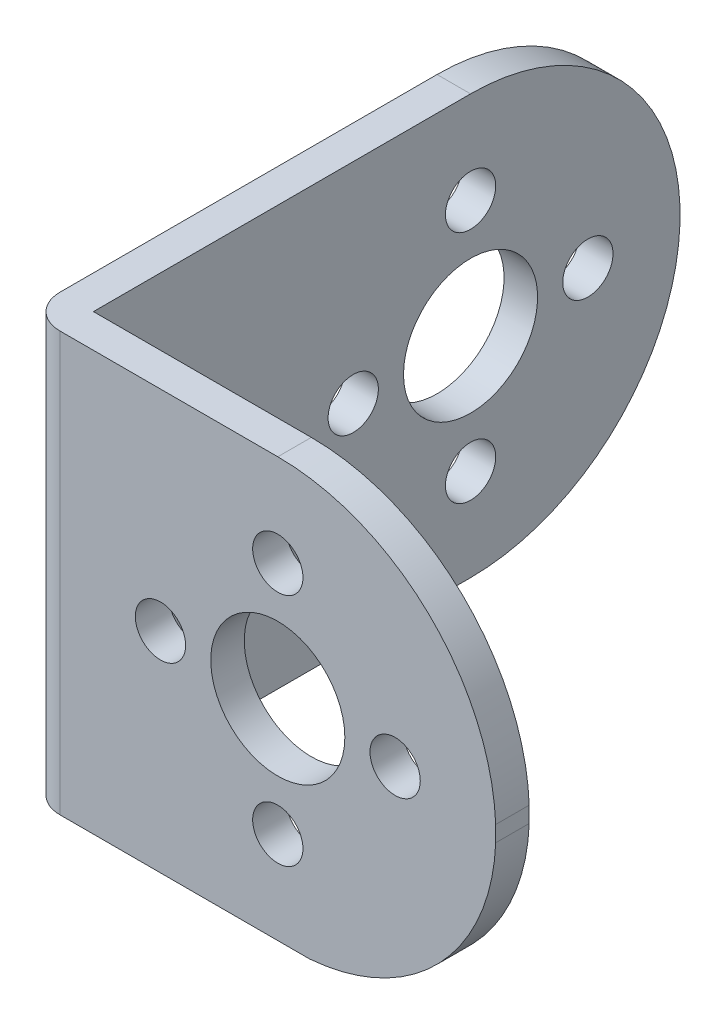
ISO-10303-21;
HEADER;
FILE_DESCRIPTION(('STEP AP214'),'2;1');
FILE_NAME('part.step','',(''),(''),'','','');
FILE_SCHEMA(('AUTOMOTIVE_DESIGN { 1 0 10303 214 1 1 1 1 }'));
ENDSEC;
DATA;
#1=APPLICATION_CONTEXT('core data for automotive mechanical design processes');
#2=APPLICATION_PROTOCOL_DEFINITION('international standard','automotive_design',2000,#1);
#3=PRODUCT_CONTEXT('',#1,'mechanical');
#4=PRODUCT('Part','Part','',(#3));
#5=PRODUCT_RELATED_PRODUCT_CATEGORY('part','',(#4));
#6=PRODUCT_DEFINITION_FORMATION('','',#4);
#7=PRODUCT_DEFINITION_CONTEXT('part definition',#1,'design');
#8=PRODUCT_DEFINITION('design','',#6,#7);
#9=PRODUCT_DEFINITION_SHAPE('','',#8);
#10=(LENGTH_UNIT() NAMED_UNIT(*) SI_UNIT(.MILLI.,.METRE.));
#11=(NAMED_UNIT(*) PLANE_ANGLE_UNIT() SI_UNIT($,.RADIAN.));
#12=(NAMED_UNIT(*) SI_UNIT($,.STERADIAN.) SOLID_ANGLE_UNIT());
#13=UNCERTAINTY_MEASURE_WITH_UNIT(LENGTH_MEASURE(1.E-05),#10,'distance_accuracy_value','');
#14=(GEOMETRIC_REPRESENTATION_CONTEXT(3) GLOBAL_UNCERTAINTY_ASSIGNED_CONTEXT((#13)) GLOBAL_UNIT_ASSIGNED_CONTEXT((#10,
#11,#12)) REPRESENTATION_CONTEXT('',''));
#15=CARTESIAN_POINT('',(0.,0.,0.));
#16=DIRECTION('',(0.,0.,1.));
#17=DIRECTION('',(1.,0.,0.));
#18=AXIS2_PLACEMENT_3D('',#15,#16,#17);
#19=CARTESIAN_POINT('',(11.0355305674655,25.,2.48106060606061));
#20=DIRECTION('',(-1.,0.,0.));
#21=DIRECTION('',(0.,0.,1.));
#22=AXIS2_PLACEMENT_3D('',#19,#20,#21);
#23=PLANE('',#22);
#24=DIRECTION('',(0.,0.,1.));
#25=VECTOR('',#24,1.);
#26=CARTESIAN_POINT('',(11.0355305674655,12.5,-32.5189393939394));
#27=LINE('',#26,#25);
#28=CARTESIAN_POINT('',(11.0355305674655,12.5,2.48106060606061));
#29=VERTEX_POINT('',#28);
#30=CARTESIAN_POINT('',(11.0355305674655,12.5,4.48106060606061));
#31=VERTEX_POINT('',#30);
#32=EDGE_CURVE('E116',#29,#31,#27,.T.);
#33=ORIENTED_EDGE('',*,*,#32,.T.);
#34=DIRECTION('',(0.,-1.,0.));
#35=VECTOR('',#34,1.);
#36=CARTESIAN_POINT('',(11.0355305674655,25.,4.48106060606061));
#37=LINE('',#36,#35);
#38=CARTESIAN_POINT('',(11.0355305674655,11.5541553813258,4.48106060606061));
#39=VERTEX_POINT('',#38);
#40=EDGE_CURVE('E128',#31,#39,#37,.T.);
#41=ORIENTED_EDGE('',*,*,#40,.T.);
#42=DIRECTION('',(0.,0.,1.));
#43=VECTOR('',#42,1.);
#44=CARTESIAN_POINT('',(11.0355305674655,11.5541553813258,-32.5189393939394));
#45=LINE('',#44,#43);
#46=CARTESIAN_POINT('',(11.0355305674655,11.5541553813258,2.48106060606061));
#47=VERTEX_POINT('',#46);
#48=EDGE_CURVE('E122',#47,#39,#45,.T.);
#49=ORIENTED_EDGE('',*,*,#48,.F.);
#50=DIRECTION('',(0.,-1.,0.));
#51=VECTOR('',#50,1.);
#52=CARTESIAN_POINT('',(11.0355305674655,25.,2.48106060606061));
#53=LINE('',#52,#51);
#54=EDGE_CURVE('E130',#29,#47,#53,.T.);
#55=ORIENTED_EDGE('',*,*,#54,.F.);
#56=EDGE_LOOP('',(#33,#41,#49,#55));
#57=FACE_BOUND('',#56,.T.);
#58=ADVANCED_FACE('F44',(#57),#23,.F.);
#59=CARTESIAN_POINT('',(-14.9644694325345,25.,2.48106060606061));
#60=DIRECTION('',(0.,0.,1.));
#61=DIRECTION('',(1.,0.,0.));
#62=AXIS2_PLACEMENT_3D('',#59,#60,#61);
#63=PLANE('',#62);
#64=CARTESIAN_POINT('',(-1.96446943253454,19.5,2.48106060606061));
#65=DIRECTION('',(0.,0.,1.));
#66=DIRECTION('',(1.,0.,0.));
#67=AXIS2_PLACEMENT_3D('',#64,#65,#66);
#68=CIRCLE('',#67,1.5);
#69=CARTESIAN_POINT('',(-0.46446943253454,19.5,2.48106060606061));
#70=VERTEX_POINT('',#69);
#71=EDGE_CURVE('E235',#70,#70,#68,.T.);
#72=ORIENTED_EDGE('',*,*,#71,.T.);
#73=EDGE_LOOP('',(#72));
#74=FACE_BOUND('',#73,.T.);
#75=CARTESIAN_POINT('',(-1.96446943253454,5.5,2.48106060606061));
#76=DIRECTION('',(0.,0.,1.));
#77=DIRECTION('',(1.,0.,0.));
#78=AXIS2_PLACEMENT_3D('',#75,#76,#77);
#79=CIRCLE('',#78,1.5);
#80=CARTESIAN_POINT('',(-0.464469432534539,5.5,2.48106060606061));
#81=VERTEX_POINT('',#80);
#82=EDGE_CURVE('E240',#81,#81,#79,.T.);
#83=ORIENTED_EDGE('',*,*,#82,.T.);
#84=EDGE_LOOP('',(#83));
#85=FACE_BOUND('',#84,.T.);
#86=CARTESIAN_POINT('',(5.03553056746546,12.5,2.48106060606061));
#87=DIRECTION('',(0.,0.,1.));
#88=DIRECTION('',(1.,0.,0.));
#89=AXIS2_PLACEMENT_3D('',#86,#87,#88);
#90=CIRCLE('',#89,1.5);
#91=CARTESIAN_POINT('',(6.53553056746546,12.5,2.48106060606061));
#92=VERTEX_POINT('',#91);
#93=EDGE_CURVE('E244',#92,#92,#90,.T.);
#94=ORIENTED_EDGE('',*,*,#93,.T.);
#95=EDGE_LOOP('',(#94));
#96=FACE_BOUND('',#95,.T.);
#97=CARTESIAN_POINT('',(-8.96446943253454,12.5,2.48106060606061));
#98=DIRECTION('',(0.,0.,1.));
#99=DIRECTION('',(1.,0.,0.));
#100=AXIS2_PLACEMENT_3D('',#97,#98,#99);
#101=CIRCLE('',#100,1.5);
#102=CARTESIAN_POINT('',(-7.46446943253454,12.5,2.48106060606061));
#103=VERTEX_POINT('',#102);
#104=EDGE_CURVE('E248',#103,#103,#101,.T.);
#105=ORIENTED_EDGE('',*,*,#104,.T.);
#106=EDGE_LOOP('',(#105));
#107=FACE_BOUND('',#106,.T.);
#108=CARTESIAN_POINT('',(-1.96446943253454,12.5,2.48106060606061));
#109=DIRECTION('',(0.,0.,1.));
#110=DIRECTION('',(1.,0.,0.));
#111=AXIS2_PLACEMENT_3D('',#108,#109,#110);
#112=CIRCLE('',#111,4.);
#113=CARTESIAN_POINT('',(2.03553056746546,12.5,2.48106060606061));
#114=VERTEX_POINT('',#113);
#115=EDGE_CURVE('E252',#114,#114,#112,.T.);
#116=ORIENTED_EDGE('',*,*,#115,.T.);
#117=EDGE_LOOP('',(#116));
#118=FACE_BOUND('',#117,.T.);
#119=CARTESIAN_POINT('',(-1.96446943253455,11.99,2.48106060606061));
#120=DIRECTION('',(0.,0.,1.));
#121=DIRECTION('',(1.,0.,0.));
#122=AXIS2_PLACEMENT_3D('',#119,#120,#121);
#123=CIRCLE('',#122,13.01);
#124=CARTESIAN_POINT('',(-1.96446943253455,25.,2.48106060606061));
#125=VERTEX_POINT('',#124);
#126=EDGE_CURVE('E59',#29,#125,#123,.T.);
#127=ORIENTED_EDGE('',*,*,#126,.F.);
#128=ORIENTED_EDGE('',*,*,#54,.T.);
#129=CARTESIAN_POINT('',(-1.01935182740269,12.0270776906629,2.48106060606061));
#130=DIRECTION('',(0.,0.,1.));
#131=DIRECTION('',(1.,0.,0.));
#132=AXIS2_PLACEMENT_3D('',#129,#130,#131);
#133=CIRCLE('',#132,12.0641553813257);
#134=CARTESIAN_POINT('',(-0.0742342222708013,0.,2.48106060606061));
#135=VERTEX_POINT('',#134);
#136=EDGE_CURVE('E132',#47,#135,#133,.F.);
#137=ORIENTED_EDGE('',*,*,#136,.T.);
#138=DIRECTION('',(-1.,0.,0.));
#139=VECTOR('',#138,1.);
#140=CARTESIAN_POINT('',(-14.9644694325345,0.,2.48106060606061));
#141=LINE('',#140,#139);
#142=CARTESIAN_POINT('',(-14.9644694325345,0.,2.48106060606061));
#143=VERTEX_POINT('',#142);
#144=EDGE_CURVE('E182',#135,#143,#141,.T.);
#145=ORIENTED_EDGE('',*,*,#144,.T.);
#146=DIRECTION('',(0.,-1.,0.));
#147=VECTOR('',#146,1.);
#148=CARTESIAN_POINT('',(-14.9644694325345,25.,2.48106060606061));
#149=LINE('',#148,#147);
#150=CARTESIAN_POINT('',(-14.9644694325345,25.,2.48106060606061));
#151=VERTEX_POINT('',#150);
#152=EDGE_CURVE('E137',#151,#143,#149,.T.);
#153=ORIENTED_EDGE('',*,*,#152,.F.);
#154=DIRECTION('',(-1.,0.,0.));
#155=VECTOR('',#154,1.);
#156=CARTESIAN_POINT('',(-14.9644694325345,25.,2.48106060606061));
#157=LINE('',#156,#155);
#158=EDGE_CURVE('E205',#125,#151,#157,.T.);
#159=ORIENTED_EDGE('',*,*,#158,.F.);
#160=EDGE_LOOP('',(#127,#128,#137,#145,#153,#159));
#161=FACE_BOUND('',#160,.T.);
#162=ADVANCED_FACE('F180',(#74,#85,#96,#107,#118,#161),#63,.F.);
#163=CARTESIAN_POINT('',(11.0355305674655,25.,4.48106060606061));
#164=DIRECTION('',(0.,0.,-1.));
#165=DIRECTION('',(-1.,0.,0.));
#166=AXIS2_PLACEMENT_3D('',#163,#164,#165);
#167=PLANE('',#166);
#168=CARTESIAN_POINT('',(-1.96446943253454,19.5,4.48106060606061));
#169=DIRECTION('',(0.,0.,1.));
#170=DIRECTION('',(1.,0.,0.));
#171=AXIS2_PLACEMENT_3D('',#168,#169,#170);
#172=CIRCLE('',#171,1.5);
#173=CARTESIAN_POINT('',(-0.46446943253454,19.5,4.48106060606061));
#174=VERTEX_POINT('',#173);
#175=EDGE_CURVE('E260',#174,#174,#172,.T.);
#176=ORIENTED_EDGE('',*,*,#175,.F.);
#177=EDGE_LOOP('',(#176));
#178=FACE_BOUND('',#177,.T.);
#179=CARTESIAN_POINT('',(-1.96446943253454,5.5,4.48106060606061));
#180=DIRECTION('',(0.,0.,1.));
#181=DIRECTION('',(1.,0.,0.));
#182=AXIS2_PLACEMENT_3D('',#179,#180,#181);
#183=CIRCLE('',#182,1.5);
#184=CARTESIAN_POINT('',(-0.464469432534539,5.5,4.48106060606061));
#185=VERTEX_POINT('',#184);
#186=EDGE_CURVE('E261',#185,#185,#183,.T.);
#187=ORIENTED_EDGE('',*,*,#186,.F.);
#188=EDGE_LOOP('',(#187));
#189=FACE_BOUND('',#188,.T.);
#190=CARTESIAN_POINT('',(5.03553056746546,12.5,4.48106060606061));
#191=DIRECTION('',(0.,0.,1.));
#192=DIRECTION('',(1.,0.,0.));
#193=AXIS2_PLACEMENT_3D('',#190,#191,#192);
#194=CIRCLE('',#193,1.5);
#195=CARTESIAN_POINT('',(6.53553056746546,12.5,4.48106060606061));
#196=VERTEX_POINT('',#195);
#197=EDGE_CURVE('E265',#196,#196,#194,.T.);
#198=ORIENTED_EDGE('',*,*,#197,.F.);
#199=EDGE_LOOP('',(#198));
#200=FACE_BOUND('',#199,.T.);
#201=CARTESIAN_POINT('',(-8.96446943253454,12.5,4.48106060606061));
#202=DIRECTION('',(0.,0.,1.));
#203=DIRECTION('',(1.,0.,0.));
#204=AXIS2_PLACEMENT_3D('',#201,#202,#203);
#205=CIRCLE('',#204,1.5);
#206=CARTESIAN_POINT('',(-7.46446943253454,12.5,4.48106060606061));
#207=VERTEX_POINT('',#206);
#208=EDGE_CURVE('E269',#207,#207,#205,.T.);
#209=ORIENTED_EDGE('',*,*,#208,.F.);
#210=EDGE_LOOP('',(#209));
#211=FACE_BOUND('',#210,.T.);
#212=CARTESIAN_POINT('',(-1.96446943253454,12.5,4.48106060606061));
#213=DIRECTION('',(0.,0.,1.));
#214=DIRECTION('',(1.,0.,0.));
#215=AXIS2_PLACEMENT_3D('',#212,#213,#214);
#216=CIRCLE('',#215,4.);
#217=CARTESIAN_POINT('',(2.03553056746546,12.5,4.48106060606061));
#218=VERTEX_POINT('',#217);
#219=EDGE_CURVE('E256',#218,#218,#216,.T.);
#220=ORIENTED_EDGE('',*,*,#219,.F.);
#221=EDGE_LOOP('',(#220));
#222=FACE_BOUND('',#221,.T.);
#223=CARTESIAN_POINT('',(-1.96446943253455,11.99,4.48106060606061));
#224=DIRECTION('',(0.,0.,1.));
#225=DIRECTION('',(1.,0.,0.));
#226=AXIS2_PLACEMENT_3D('',#223,#224,#225);
#227=CIRCLE('',#226,13.01);
#228=CARTESIAN_POINT('',(-1.96446943253454,25.,4.48106060606061));
#229=VERTEX_POINT('',#228);
#230=EDGE_CURVE('E113',#31,#229,#227,.T.);
#231=ORIENTED_EDGE('',*,*,#230,.T.);
#232=DIRECTION('',(1.,0.,0.));
#233=VECTOR('',#232,1.);
#234=CARTESIAN_POINT('',(11.0355305674655,25.,4.48106060606061));
#235=LINE('',#234,#233);
#236=CARTESIAN_POINT('',(-14.9644694325345,25.,4.48106060606061));
#237=VERTEX_POINT('',#236);
#238=EDGE_CURVE('E138',#237,#229,#235,.T.);
#239=ORIENTED_EDGE('',*,*,#238,.F.);
#240=DIRECTION('',(0.,-1.,0.));
#241=VECTOR('',#240,1.);
#242=CARTESIAN_POINT('',(-14.9644694325345,25.,4.48106060606061));
#243=LINE('',#242,#241);
#244=CARTESIAN_POINT('',(-14.9644694325345,0.,4.48106060606061));
#245=VERTEX_POINT('',#244);
#246=EDGE_CURVE('E152',#237,#245,#243,.T.);
#247=ORIENTED_EDGE('',*,*,#246,.T.);
#248=DIRECTION('',(1.,0.,0.));
#249=VECTOR('',#248,1.);
#250=CARTESIAN_POINT('',(11.0355305674655,0.,4.48106060606061));
#251=LINE('',#250,#249);
#252=CARTESIAN_POINT('',(-0.0742342222708019,0.,4.48106060606061));
#253=VERTEX_POINT('',#252);
#254=EDGE_CURVE('E147',#245,#253,#251,.T.);
#255=ORIENTED_EDGE('',*,*,#254,.T.);
#256=CARTESIAN_POINT('',(-1.01935182740269,12.0270776906629,4.48106060606061));
#257=DIRECTION('',(0.,0.,1.));
#258=DIRECTION('',(1.,0.,0.));
#259=AXIS2_PLACEMENT_3D('',#256,#257,#258);
#260=CIRCLE('',#259,12.0641553813257);
#261=EDGE_CURVE('E67',#39,#253,#260,.F.);
#262=ORIENTED_EDGE('',*,*,#261,.F.);
#263=ORIENTED_EDGE('',*,*,#40,.F.);
#264=EDGE_LOOP('',(#231,#239,#247,#255,#262,#263));
#265=FACE_BOUND('',#264,.T.);
#266=ADVANCED_FACE('F134',(#178,#189,#200,#211,#222,#265),#167,.F.);
#267=CARTESIAN_POINT('',(0.,25.,0.));
#268=DIRECTION('',(0.,-1.,0.));
#269=DIRECTION('',(0.,0.,-1.));
#270=AXIS2_PLACEMENT_3D('',#267,#268,#269);
#271=PLANE('',#270);
#272=DIRECTION('',(0.,0.,1.));
#273=VECTOR('',#272,1.);
#274=CARTESIAN_POINT('',(-1.96446943253455,25.,-32.5189393939394));
#275=LINE('',#274,#273);
#276=EDGE_CURVE('E11',#125,#229,#275,.T.);
#277=ORIENTED_EDGE('',*,*,#276,.F.);
#278=ORIENTED_EDGE('',*,*,#158,.T.);
#279=DIRECTION('',(0.,0.,-1.));
#280=VECTOR('',#279,1.);
#281=CARTESIAN_POINT('',(-14.9644694325345,25.,-32.5189393939394));
#282=LINE('',#281,#280);
#283=CARTESIAN_POINT('',(-14.9644694325345,25.,-20.0189393939394));
#284=VERTEX_POINT('',#283);
#285=EDGE_CURVE('E207',#151,#284,#282,.T.);
#286=ORIENTED_EDGE('',*,*,#285,.T.);
#287=DIRECTION('',(-1.,0.,0.));
#288=VECTOR('',#287,1.);
#289=CARTESIAN_POINT('',(11.0355305674655,25.,-20.0189393939394));
#290=LINE('',#289,#288);
#291=CARTESIAN_POINT('',(-16.9644694325345,25.,-20.0189393939394));
#292=VERTEX_POINT('',#291);
#293=EDGE_CURVE('E170',#284,#292,#290,.T.);
#294=ORIENTED_EDGE('',*,*,#293,.T.);
#295=DIRECTION('',(0.,0.,1.));
#296=VECTOR('',#295,1.);
#297=CARTESIAN_POINT('',(-16.9644694325345,25.,4.48106060606061));
#298=LINE('',#297,#296);
#299=CARTESIAN_POINT('',(-16.9644694325345,25.,2.48106060606061));
#300=VERTEX_POINT('',#299);
#301=EDGE_CURVE('E144',#292,#300,#298,.T.);
#302=ORIENTED_EDGE('',*,*,#301,.T.);
#303=CARTESIAN_POINT('',(-14.9644694325345,25.,2.48106060606061));
#304=DIRECTION('',(0.,-1.,0.));
#305=DIRECTION('',(0.,0.,-1.));
#306=AXIS2_PLACEMENT_3D('',#303,#304,#305);
#307=CIRCLE('',#306,2.);
#308=EDGE_CURVE('E164',#300,#237,#307,.F.);
#309=ORIENTED_EDGE('',*,*,#308,.T.);
#310=ORIENTED_EDGE('',*,*,#238,.T.);
#311=EDGE_LOOP('',(#277,#278,#286,#294,#302,#309,#310));
#312=FACE_BOUND('',#311,.T.);
#313=ADVANCED_FACE('F217',(#312),#271,.F.);
#314=CARTESIAN_POINT('',(-14.9644694325345,25.,-32.5189393939394));
#315=DIRECTION('',(-1.,0.,0.));
#316=DIRECTION('',(0.,0.,1.));
#317=AXIS2_PLACEMENT_3D('',#314,#315,#316);
#318=PLANE('',#317);
#319=CARTESIAN_POINT('',(-14.9644694325345,12.5,-27.0189393939394));
#320=DIRECTION('',(-1.,0.,0.));
#321=DIRECTION('',(0.,0.,1.));
#322=AXIS2_PLACEMENT_3D('',#319,#320,#321);
#323=CIRCLE('',#322,1.5);
#324=CARTESIAN_POINT('',(-14.9644694325345,12.5,-25.5189393939394));
#325=VERTEX_POINT('',#324);
#326=EDGE_CURVE('E273',#325,#325,#323,.T.);
#327=ORIENTED_EDGE('',*,*,#326,.T.);
#328=EDGE_LOOP('',(#327));
#329=FACE_BOUND('',#328,.T.);
#330=CARTESIAN_POINT('',(-14.9644694325345,19.5,-20.0189393939394));
#331=DIRECTION('',(-1.,0.,0.));
#332=DIRECTION('',(0.,0.,1.));
#333=AXIS2_PLACEMENT_3D('',#330,#331,#332);
#334=CIRCLE('',#333,1.5);
#335=CARTESIAN_POINT('',(-14.9644694325345,19.5,-18.5189393939394));
#336=VERTEX_POINT('',#335);
#337=EDGE_CURVE('E280',#336,#336,#334,.T.);
#338=ORIENTED_EDGE('',*,*,#337,.T.);
#339=EDGE_LOOP('',(#338));
#340=FACE_BOUND('',#339,.T.);
#341=CARTESIAN_POINT('',(-14.9644694325345,5.5,-20.0189393939394));
#342=DIRECTION('',(-1.,0.,0.));
#343=DIRECTION('',(0.,0.,1.));
#344=AXIS2_PLACEMENT_3D('',#341,#342,#343);
#345=CIRCLE('',#344,1.5);
#346=CARTESIAN_POINT('',(-14.9644694325345,5.5,-18.5189393939394));
#347=VERTEX_POINT('',#346);
#348=EDGE_CURVE('E284',#347,#347,#345,.T.);
#349=ORIENTED_EDGE('',*,*,#348,.T.);
#350=EDGE_LOOP('',(#349));
#351=FACE_BOUND('',#350,.T.);
#352=CARTESIAN_POINT('',(-14.9644694325345,12.5,-13.0189393939394));
#353=DIRECTION('',(-1.,0.,0.));
#354=DIRECTION('',(0.,0.,1.));
#355=AXIS2_PLACEMENT_3D('',#352,#353,#354);
#356=CIRCLE('',#355,1.5);
#357=CARTESIAN_POINT('',(-14.9644694325345,12.5,-11.5189393939394));
#358=VERTEX_POINT('',#357);
#359=EDGE_CURVE('E288',#358,#358,#356,.T.);
#360=ORIENTED_EDGE('',*,*,#359,.T.);
#361=EDGE_LOOP('',(#360));
#362=FACE_BOUND('',#361,.T.);
#363=CARTESIAN_POINT('',(-14.9644694325345,12.5,-20.0189393939394));
#364=DIRECTION('',(-1.,0.,0.));
#365=DIRECTION('',(0.,0.,1.));
#366=AXIS2_PLACEMENT_3D('',#363,#364,#365);
#367=CIRCLE('',#366,4.);
#368=CARTESIAN_POINT('',(-14.9644694325345,12.5,-16.0189393939394));
#369=VERTEX_POINT('',#368);
#370=EDGE_CURVE('E292',#369,#369,#367,.T.);
#371=ORIENTED_EDGE('',*,*,#370,.T.);
#372=EDGE_LOOP('',(#371));
#373=FACE_BOUND('',#372,.T.);
#374=CARTESIAN_POINT('',(-14.9644694325345,12.5,-20.0189393939394));
#375=DIRECTION('',(-1.,0.,0.));
#376=DIRECTION('',(0.,0.,1.));
#377=AXIS2_PLACEMENT_3D('',#374,#375,#376);
#378=CIRCLE('',#377,12.5);
#379=CARTESIAN_POINT('',(-14.9644694325345,0.,-20.0189393939394));
#380=VERTEX_POINT('',#379);
#381=EDGE_CURVE('E191',#284,#380,#378,.T.);
#382=ORIENTED_EDGE('',*,*,#381,.F.);
#383=ORIENTED_EDGE('',*,*,#285,.F.);
#384=ORIENTED_EDGE('',*,*,#152,.T.);
#385=DIRECTION('',(0.,0.,-1.));
#386=VECTOR('',#385,1.);
#387=CARTESIAN_POINT('',(-14.9644694325345,0.,-32.5189393939394));
#388=LINE('',#387,#386);
#389=EDGE_CURVE('E189',#143,#380,#388,.T.);
#390=ORIENTED_EDGE('',*,*,#389,.T.);
#391=EDGE_LOOP('',(#382,#383,#384,#390));
#392=FACE_BOUND('',#391,.T.);
#393=ADVANCED_FACE('F226',(#329,#340,#351,#362,#373,#392),#318,.F.);
#394=CARTESIAN_POINT('',(-16.9644694325345,25.,4.48106060606061));
#395=DIRECTION('',(1.,0.,0.));
#396=DIRECTION('',(0.,0.,-1.));
#397=AXIS2_PLACEMENT_3D('',#394,#395,#396);
#398=PLANE('',#397);
#399=CARTESIAN_POINT('',(-16.9644694325345,12.5,-27.0189393939394));
#400=DIRECTION('',(-1.,0.,0.));
#401=DIRECTION('',(0.,0.,1.));
#402=AXIS2_PLACEMENT_3D('',#399,#400,#401);
#403=CIRCLE('',#402,1.5);
#404=CARTESIAN_POINT('',(-16.9644694325345,12.5,-25.5189393939394));
#405=VERTEX_POINT('',#404);
#406=EDGE_CURVE('E300',#405,#405,#403,.T.);
#407=ORIENTED_EDGE('',*,*,#406,.F.);
#408=EDGE_LOOP('',(#407));
#409=FACE_BOUND('',#408,.T.);
#410=CARTESIAN_POINT('',(-16.9644694325345,19.5,-20.0189393939394));
#411=DIRECTION('',(-1.,0.,0.));
#412=DIRECTION('',(0.,0.,1.));
#413=AXIS2_PLACEMENT_3D('',#410,#411,#412);
#414=CIRCLE('',#413,1.5);
#415=CARTESIAN_POINT('',(-16.9644694325345,19.5,-18.5189393939394));
#416=VERTEX_POINT('',#415);
#417=EDGE_CURVE('E301',#416,#416,#414,.T.);
#418=ORIENTED_EDGE('',*,*,#417,.F.);
#419=EDGE_LOOP('',(#418));
#420=FACE_BOUND('',#419,.T.);
#421=CARTESIAN_POINT('',(-16.9644694325345,5.5,-20.0189393939394));
#422=DIRECTION('',(-1.,0.,0.));
#423=DIRECTION('',(0.,0.,1.));
#424=AXIS2_PLACEMENT_3D('',#421,#422,#423);
#425=CIRCLE('',#424,1.5);
#426=CARTESIAN_POINT('',(-16.9644694325345,5.5,-18.5189393939394));
#427=VERTEX_POINT('',#426);
#428=EDGE_CURVE('E305',#427,#427,#425,.T.);
#429=ORIENTED_EDGE('',*,*,#428,.F.);
#430=EDGE_LOOP('',(#429));
#431=FACE_BOUND('',#430,.T.);
#432=CARTESIAN_POINT('',(-16.9644694325345,12.5,-13.0189393939394));
#433=DIRECTION('',(-1.,0.,0.));
#434=DIRECTION('',(0.,0.,1.));
#435=AXIS2_PLACEMENT_3D('',#432,#433,#434);
#436=CIRCLE('',#435,1.5);
#437=CARTESIAN_POINT('',(-16.9644694325345,12.5,-11.5189393939394));
#438=VERTEX_POINT('',#437);
#439=EDGE_CURVE('E309',#438,#438,#436,.T.);
#440=ORIENTED_EDGE('',*,*,#439,.F.);
#441=EDGE_LOOP('',(#440));
#442=FACE_BOUND('',#441,.T.);
#443=CARTESIAN_POINT('',(-16.9644694325345,12.5,-20.0189393939394));
#444=DIRECTION('',(-1.,0.,0.));
#445=DIRECTION('',(0.,0.,1.));
#446=AXIS2_PLACEMENT_3D('',#443,#444,#445);
#447=CIRCLE('',#446,4.);
#448=CARTESIAN_POINT('',(-16.9644694325345,12.5,-16.0189393939394));
#449=VERTEX_POINT('',#448);
#450=EDGE_CURVE('E296',#449,#449,#447,.T.);
#451=ORIENTED_EDGE('',*,*,#450,.F.);
#452=EDGE_LOOP('',(#451));
#453=FACE_BOUND('',#452,.T.);
#454=ORIENTED_EDGE('',*,*,#301,.F.);
#455=CARTESIAN_POINT('',(-16.9644694325345,12.5,-20.0189393939394));
#456=DIRECTION('',(-1.,0.,0.));
#457=DIRECTION('',(0.,0.,1.));
#458=AXIS2_PLACEMENT_3D('',#455,#456,#457);
#459=CIRCLE('',#458,12.5);
#460=CARTESIAN_POINT('',(-16.9644694325345,0.,-20.0189393939394));
#461=VERTEX_POINT('',#460);
#462=EDGE_CURVE('E197',#292,#461,#459,.T.);
#463=ORIENTED_EDGE('',*,*,#462,.T.);
#464=DIRECTION('',(0.,0.,1.));
#465=VECTOR('',#464,1.);
#466=CARTESIAN_POINT('',(-16.9644694325345,0.,4.48106060606061));
#467=LINE('',#466,#465);
#468=CARTESIAN_POINT('',(-16.9644694325345,0.,2.48106060606061));
#469=VERTEX_POINT('',#468);
#470=EDGE_CURVE('E195',#461,#469,#467,.T.);
#471=ORIENTED_EDGE('',*,*,#470,.T.);
#472=DIRECTION('',(0.,-1.,0.));
#473=VECTOR('',#472,1.);
#474=CARTESIAN_POINT('',(-16.9644694325345,25.,2.48106060606061));
#475=LINE('',#474,#473);
#476=EDGE_CURVE('E160',#469,#300,#475,.F.);
#477=ORIENTED_EDGE('',*,*,#476,.T.);
#478=EDGE_LOOP('',(#454,#463,#471,#477));
#479=FACE_BOUND('',#478,.T.);
#480=ADVANCED_FACE('F221',(#409,#420,#431,#442,#453,#479),#398,.F.);
#481=CARTESIAN_POINT('',(0.,0.,0.));
#482=DIRECTION('',(0.,-1.,0.));
#483=DIRECTION('',(0.,0.,-1.));
#484=AXIS2_PLACEMENT_3D('',#481,#482,#483);
#485=PLANE('',#484);
#486=DIRECTION('',(0.,0.,1.));
#487=VECTOR('',#486,1.);
#488=CARTESIAN_POINT('',(-0.0742342222708013,0.,-32.5189393939394));
#489=LINE('',#488,#487);
#490=EDGE_CURVE('E53',#253,#135,#489,.F.);
#491=ORIENTED_EDGE('',*,*,#490,.F.);
#492=ORIENTED_EDGE('',*,*,#254,.F.);
#493=CARTESIAN_POINT('',(-14.9644694325345,0.,2.48106060606061));
#494=DIRECTION('',(0.,-1.,0.));
#495=DIRECTION('',(0.,0.,-1.));
#496=AXIS2_PLACEMENT_3D('',#493,#494,#495);
#497=CIRCLE('',#496,2.);
#498=EDGE_CURVE('E156',#245,#469,#497,.T.);
#499=ORIENTED_EDGE('',*,*,#498,.T.);
#500=ORIENTED_EDGE('',*,*,#470,.F.);
#501=DIRECTION('',(-1.,0.,0.));
#502=VECTOR('',#501,1.);
#503=CARTESIAN_POINT('',(11.0355305674655,0.,-20.0189393939394));
#504=LINE('',#503,#502);
#505=EDGE_CURVE('E167',#380,#461,#504,.T.);
#506=ORIENTED_EDGE('',*,*,#505,.F.);
#507=ORIENTED_EDGE('',*,*,#389,.F.);
#508=ORIENTED_EDGE('',*,*,#144,.F.);
#509=EDGE_LOOP('',(#491,#492,#499,#500,#506,#507,#508));
#510=FACE_BOUND('',#509,.T.);
#511=ADVANCED_FACE('F186',(#510),#485,.T.);
#512=CARTESIAN_POINT('',(-14.9644694325345,25.,2.48106060606061));
#513=DIRECTION('',(0.,-1.,0.));
#514=DIRECTION('',(0.,0.,-1.));
#515=AXIS2_PLACEMENT_3D('',#512,#513,#514);
#516=CYLINDRICAL_SURFACE('',#515,2.);
#517=ORIENTED_EDGE('',*,*,#308,.F.);
#518=ORIENTED_EDGE('',*,*,#476,.F.);
#519=ORIENTED_EDGE('',*,*,#498,.F.);
#520=ORIENTED_EDGE('',*,*,#246,.F.);
#521=EDGE_LOOP('',(#517,#518,#519,#520));
#522=FACE_BOUND('',#521,.T.);
#523=ADVANCED_FACE('F46',(#522),#516,.T.);
#524=CARTESIAN_POINT('',(11.0355305674655,12.5,-20.0189393939394));
#525=DIRECTION('',(-1.,0.,0.));
#526=DIRECTION('',(0.,0.,1.));
#527=AXIS2_PLACEMENT_3D('',#524,#525,#526);
#528=CYLINDRICAL_SURFACE('',#527,12.5);
#529=ORIENTED_EDGE('',*,*,#381,.T.);
#530=ORIENTED_EDGE('',*,*,#505,.T.);
#531=ORIENTED_EDGE('',*,*,#462,.F.);
#532=ORIENTED_EDGE('',*,*,#293,.F.);
#533=EDGE_LOOP('',(#529,#530,#531,#532));
#534=FACE_BOUND('',#533,.T.);
#535=ADVANCED_FACE('F384',(#534),#528,.T.);
#536=CARTESIAN_POINT('',(-1.01935182740269,12.0270776906629,-32.5189393939394));
#537=DIRECTION('',(0.,0.,1.));
#538=DIRECTION('',(1.,0.,0.));
#539=AXIS2_PLACEMENT_3D('',#536,#537,#538);
#540=CYLINDRICAL_SURFACE('',#539,12.0641553813257);
#541=ORIENTED_EDGE('',*,*,#48,.T.);
#542=ORIENTED_EDGE('',*,*,#261,.T.);
#543=ORIENTED_EDGE('',*,*,#490,.T.);
#544=ORIENTED_EDGE('',*,*,#136,.F.);
#545=EDGE_LOOP('',(#541,#542,#543,#544));
#546=FACE_BOUND('',#545,.T.);
#547=ADVANCED_FACE('F175',(#546),#540,.T.);
#548=CARTESIAN_POINT('',(-1.96446943253455,11.99,-32.5189393939394));
#549=DIRECTION('',(0.,0.,1.));
#550=DIRECTION('',(1.,0.,0.));
#551=AXIS2_PLACEMENT_3D('',#548,#549,#550);
#552=CYLINDRICAL_SURFACE('',#551,13.01);
#553=ORIENTED_EDGE('',*,*,#126,.T.);
#554=ORIENTED_EDGE('',*,*,#276,.T.);
#555=ORIENTED_EDGE('',*,*,#230,.F.);
#556=ORIENTED_EDGE('',*,*,#32,.F.);
#557=EDGE_LOOP('',(#553,#554,#555,#556));
#558=FACE_BOUND('',#557,.T.);
#559=ADVANCED_FACE('F115',(#558),#552,.T.);
#560=CARTESIAN_POINT('',(-1.96446943253454,12.5,-32.5189393939394));
#561=DIRECTION('',(0.,0.,1.));
#562=DIRECTION('',(1.,0.,0.));
#563=AXIS2_PLACEMENT_3D('',#560,#561,#562);
#564=CYLINDRICAL_SURFACE('',#563,4.);
#565=ORIENTED_EDGE('',*,*,#219,.T.);
#566=EDGE_LOOP('',(#565));
#567=FACE_BOUND('',#566,.T.);
#568=ORIENTED_EDGE('',*,*,#115,.F.);
#569=EDGE_LOOP('',(#568));
#570=FACE_BOUND('',#569,.T.);
#571=ADVANCED_FACE('F365',(#567,#570),#564,.F.);
#572=CARTESIAN_POINT('',(-8.96446943253454,12.5,-32.5189393939394));
#573=DIRECTION('',(0.,0.,1.));
#574=DIRECTION('',(1.,0.,0.));
#575=AXIS2_PLACEMENT_3D('',#572,#573,#574);
#576=CYLINDRICAL_SURFACE('',#575,1.5);
#577=ORIENTED_EDGE('',*,*,#208,.T.);
#578=EDGE_LOOP('',(#577));
#579=FACE_BOUND('',#578,.T.);
#580=ORIENTED_EDGE('',*,*,#104,.F.);
#581=EDGE_LOOP('',(#580));
#582=FACE_BOUND('',#581,.T.);
#583=ADVANCED_FACE('F367',(#579,#582),#576,.F.);
#584=CARTESIAN_POINT('',(5.03553056746546,12.5,-32.5189393939394));
#585=DIRECTION('',(0.,0.,1.));
#586=DIRECTION('',(1.,0.,0.));
#587=AXIS2_PLACEMENT_3D('',#584,#585,#586);
#588=CYLINDRICAL_SURFACE('',#587,1.5);
#589=ORIENTED_EDGE('',*,*,#197,.T.);
#590=EDGE_LOOP('',(#589));
#591=FACE_BOUND('',#590,.T.);
#592=ORIENTED_EDGE('',*,*,#93,.F.);
#593=EDGE_LOOP('',(#592));
#594=FACE_BOUND('',#593,.T.);
#595=ADVANCED_FACE('F374',(#591,#594),#588,.F.);
#596=CARTESIAN_POINT('',(-1.96446943253454,5.5,-32.5189393939394));
#597=DIRECTION('',(0.,0.,1.));
#598=DIRECTION('',(1.,0.,0.));
#599=AXIS2_PLACEMENT_3D('',#596,#597,#598);
#600=CYLINDRICAL_SURFACE('',#599,1.5);
#601=ORIENTED_EDGE('',*,*,#186,.T.);
#602=EDGE_LOOP('',(#601));
#603=FACE_BOUND('',#602,.T.);
#604=ORIENTED_EDGE('',*,*,#82,.F.);
#605=EDGE_LOOP('',(#604));
#606=FACE_BOUND('',#605,.T.);
#607=ADVANCED_FACE('F379',(#603,#606),#600,.F.);
#608=CARTESIAN_POINT('',(-1.96446943253454,19.5,-32.5189393939394));
#609=DIRECTION('',(0.,0.,1.));
#610=DIRECTION('',(1.,0.,0.));
#611=AXIS2_PLACEMENT_3D('',#608,#609,#610);
#612=CYLINDRICAL_SURFACE('',#611,1.5);
#613=ORIENTED_EDGE('',*,*,#175,.T.);
#614=EDGE_LOOP('',(#613));
#615=FACE_BOUND('',#614,.T.);
#616=ORIENTED_EDGE('',*,*,#71,.F.);
#617=EDGE_LOOP('',(#616));
#618=FACE_BOUND('',#617,.T.);
#619=ADVANCED_FACE('F332',(#615,#618),#612,.F.);
#620=CARTESIAN_POINT('',(11.0355305674655,12.5,-20.0189393939394));
#621=DIRECTION('',(-1.,0.,0.));
#622=DIRECTION('',(0.,0.,1.));
#623=AXIS2_PLACEMENT_3D('',#620,#621,#622);
#624=CYLINDRICAL_SURFACE('',#623,4.);
#625=ORIENTED_EDGE('',*,*,#450,.T.);
#626=EDGE_LOOP('',(#625));
#627=FACE_BOUND('',#626,.T.);
#628=ORIENTED_EDGE('',*,*,#370,.F.);
#629=EDGE_LOOP('',(#628));
#630=FACE_BOUND('',#629,.T.);
#631=ADVANCED_FACE('F328',(#627,#630),#624,.F.);
#632=CARTESIAN_POINT('',(11.0355305674655,12.5,-13.0189393939394));
#633=DIRECTION('',(-1.,0.,0.));
#634=DIRECTION('',(0.,0.,1.));
#635=AXIS2_PLACEMENT_3D('',#632,#633,#634);
#636=CYLINDRICAL_SURFACE('',#635,1.5);
#637=ORIENTED_EDGE('',*,*,#439,.T.);
#638=EDGE_LOOP('',(#637));
#639=FACE_BOUND('',#638,.T.);
#640=ORIENTED_EDGE('',*,*,#359,.F.);
#641=EDGE_LOOP('',(#640));
#642=FACE_BOUND('',#641,.T.);
#643=ADVANCED_FACE('F331',(#639,#642),#636,.F.);
#644=CARTESIAN_POINT('',(11.0355305674655,5.5,-20.0189393939394));
#645=DIRECTION('',(-1.,0.,0.));
#646=DIRECTION('',(0.,0.,1.));
#647=AXIS2_PLACEMENT_3D('',#644,#645,#646);
#648=CYLINDRICAL_SURFACE('',#647,1.5);
#649=ORIENTED_EDGE('',*,*,#428,.T.);
#650=EDGE_LOOP('',(#649));
#651=FACE_BOUND('',#650,.T.);
#652=ORIENTED_EDGE('',*,*,#348,.F.);
#653=EDGE_LOOP('',(#652));
#654=FACE_BOUND('',#653,.T.);
#655=ADVANCED_FACE('F317',(#651,#654),#648,.F.);
#656=CARTESIAN_POINT('',(11.0355305674655,19.5,-20.0189393939394));
#657=DIRECTION('',(-1.,0.,0.));
#658=DIRECTION('',(0.,0.,1.));
#659=AXIS2_PLACEMENT_3D('',#656,#657,#658);
#660=CYLINDRICAL_SURFACE('',#659,1.5);
#661=ORIENTED_EDGE('',*,*,#417,.T.);
#662=EDGE_LOOP('',(#661));
#663=FACE_BOUND('',#662,.T.);
#664=ORIENTED_EDGE('',*,*,#337,.F.);
#665=EDGE_LOOP('',(#664));
#666=FACE_BOUND('',#665,.T.);
#667=ADVANCED_FACE('F497',(#663,#666),#660,.F.);
#668=CARTESIAN_POINT('',(11.0355305674655,12.5,-27.0189393939394));
#669=DIRECTION('',(-1.,0.,0.));
#670=DIRECTION('',(0.,0.,1.));
#671=AXIS2_PLACEMENT_3D('',#668,#669,#670);
#672=CYLINDRICAL_SURFACE('',#671,1.5);
#673=ORIENTED_EDGE('',*,*,#406,.T.);
#674=EDGE_LOOP('',(#673));
#675=FACE_BOUND('',#674,.T.);
#676=ORIENTED_EDGE('',*,*,#326,.F.);
#677=EDGE_LOOP('',(#676));
#678=FACE_BOUND('',#677,.T.);
#679=ADVANCED_FACE('F507',(#675,#678),#672,.F.);
#680=CLOSED_SHELL('',(#58,#162,#266,#313,#393,#480,#511,#523,#535,#547,#559,#571,#583,#595,#607,
#619,#631,#643,#655,#667,#679));
#681=MANIFOLD_SOLID_BREP('B2',#680);
#682=ADVANCED_BREP_SHAPE_REPRESENTATION('',(#18,#681),#14);
#683=SHAPE_DEFINITION_REPRESENTATION(#9,#682);
ENDSEC;
END-ISO-10303-21;
